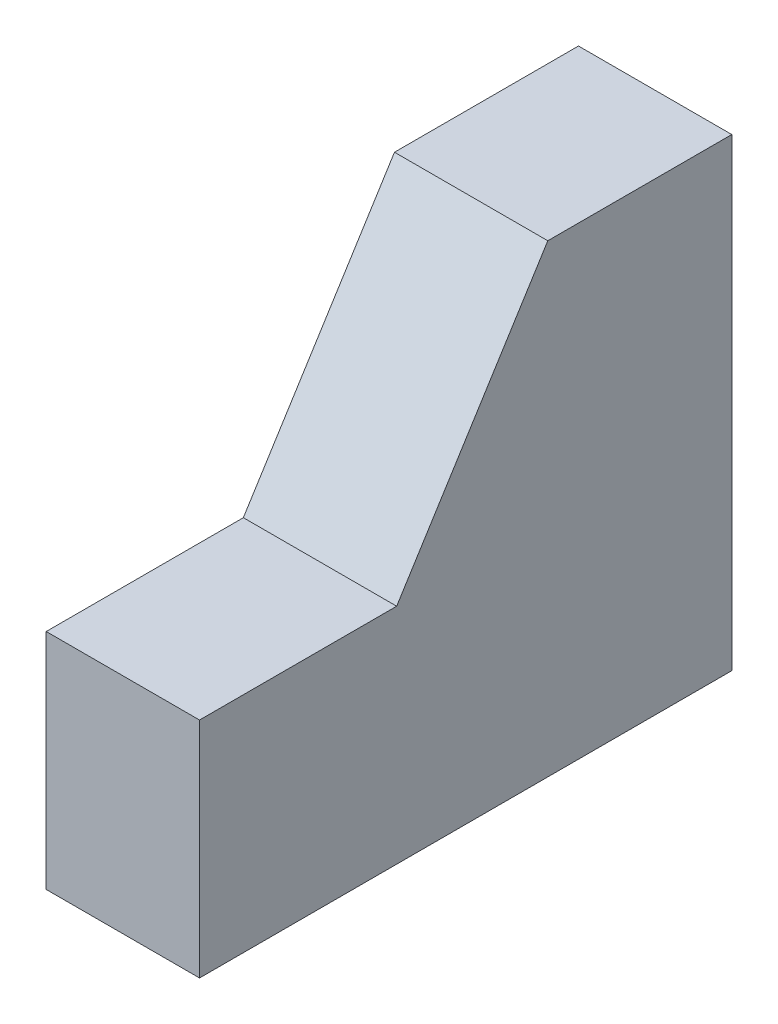
ISO-10303-21;
HEADER;
FILE_DESCRIPTION(('STEP AP214'),'2;1');
FILE_NAME('part.step','',(''),(''),'','','');
FILE_SCHEMA(('AUTOMOTIVE_DESIGN { 1 0 10303 214 1 1 1 1 }'));
ENDSEC;
DATA;
#1=APPLICATION_CONTEXT('core data for automotive mechanical design processes');
#2=APPLICATION_PROTOCOL_DEFINITION('international standard','automotive_design',2000,#1);
#3=PRODUCT_CONTEXT('',#1,'mechanical');
#4=PRODUCT('Part','Part','',(#3));
#5=PRODUCT_RELATED_PRODUCT_CATEGORY('part','',(#4));
#6=PRODUCT_DEFINITION_FORMATION('','',#4);
#7=PRODUCT_DEFINITION_CONTEXT('part definition',#1,'design');
#8=PRODUCT_DEFINITION('design','',#6,#7);
#9=PRODUCT_DEFINITION_SHAPE('','',#8);
#10=(LENGTH_UNIT() NAMED_UNIT(*) SI_UNIT(.MILLI.,.METRE.));
#11=(NAMED_UNIT(*) PLANE_ANGLE_UNIT() SI_UNIT($,.RADIAN.));
#12=(NAMED_UNIT(*) SI_UNIT($,.STERADIAN.) SOLID_ANGLE_UNIT());
#13=UNCERTAINTY_MEASURE_WITH_UNIT(LENGTH_MEASURE(1.E-05),#10,'distance_accuracy_value','');
#14=(GEOMETRIC_REPRESENTATION_CONTEXT(3) GLOBAL_UNCERTAINTY_ASSIGNED_CONTEXT((#13)) GLOBAL_UNIT_ASSIGNED_CONTEXT((#10,
#11,#12)) REPRESENTATION_CONTEXT('',''));
#15=CARTESIAN_POINT('',(0.,0.,0.));
#16=DIRECTION('',(0.,0.,1.));
#17=DIRECTION('',(1.,0.,0.));
#18=AXIS2_PLACEMENT_3D('',#15,#16,#17);
#19=CARTESIAN_POINT('',(7.,0.,-24.3));
#20=DIRECTION('',(0.,1.,0.));
#21=DIRECTION('',(0.,0.,1.));
#22=AXIS2_PLACEMENT_3D('',#19,#20,#21);
#23=PLANE('',#22);
#24=CARTESIAN_POINT('',(3.5,0.,-5.35));
#25=DIRECTION('',(0.,-1.,0.));
#26=DIRECTION('',(0.,0.,-1.));
#27=AXIS2_PLACEMENT_3D('',#24,#25,#26);
#28=CIRCLE('',#27,1.45);
#29=CARTESIAN_POINT('',(3.5,0.,-6.8));
#30=VERTEX_POINT('',#29);
#31=EDGE_CURVE('E161',#30,#30,#28,.T.);
#32=ORIENTED_EDGE('',*,*,#31,.F.);
#33=EDGE_LOOP('',(#32));
#34=FACE_BOUND('',#33,.T.);
#35=CARTESIAN_POINT('',(3.5,0.,-14.75));
#36=DIRECTION('',(0.,-1.,0.));
#37=DIRECTION('',(0.,0.,-1.));
#38=AXIS2_PLACEMENT_3D('',#35,#36,#37);
#39=CIRCLE('',#38,1.45);
#40=CARTESIAN_POINT('',(3.5,0.,-16.2));
#41=VERTEX_POINT('',#40);
#42=EDGE_CURVE('E164',#41,#41,#39,.T.);
#43=ORIENTED_EDGE('',*,*,#42,.F.);
#44=EDGE_LOOP('',(#43));
#45=FACE_BOUND('',#44,.T.);
#46=DIRECTION('',(0.,0.,-1.));
#47=VECTOR('',#46,1.);
#48=CARTESIAN_POINT('',(0.,0.,-24.3));
#49=LINE('',#48,#47);
#50=CARTESIAN_POINT('',(0.,0.,0.));
#51=VERTEX_POINT('',#50);
#52=CARTESIAN_POINT('',(0.,0.,-24.3));
#53=VERTEX_POINT('',#52);
#54=EDGE_CURVE('E117',#51,#53,#49,.T.);
#55=ORIENTED_EDGE('',*,*,#54,.T.);
#56=DIRECTION('',(-1.,0.,0.));
#57=VECTOR('',#56,1.);
#58=CARTESIAN_POINT('',(7.,0.,-24.3));
#59=LINE('',#58,#57);
#60=CARTESIAN_POINT('',(7.,0.,-24.3));
#61=VERTEX_POINT('',#60);
#62=EDGE_CURVE('E11',#61,#53,#59,.T.);
#63=ORIENTED_EDGE('',*,*,#62,.F.);
#64=DIRECTION('',(0.,0.,-1.));
#65=VECTOR('',#64,1.);
#66=CARTESIAN_POINT('',(7.,0.,-24.3));
#67=LINE('',#66,#65);
#68=CARTESIAN_POINT('',(7.,0.,0.));
#69=VERTEX_POINT('',#68);
#70=EDGE_CURVE('E128',#69,#61,#67,.T.);
#71=ORIENTED_EDGE('',*,*,#70,.F.);
#72=DIRECTION('',(-1.,0.,0.));
#73=VECTOR('',#72,1.);
#74=CARTESIAN_POINT('',(7.,0.,0.));
#75=LINE('',#74,#73);
#76=EDGE_CURVE('E113',#69,#51,#75,.T.);
#77=ORIENTED_EDGE('',*,*,#76,.T.);
#78=EDGE_LOOP('',(#55,#63,#71,#77));
#79=FACE_BOUND('',#78,.T.);
#80=ADVANCED_FACE('F33',(#34,#45,#79),#23,.F.);
#81=CARTESIAN_POINT('',(7.,21.2,-24.3));
#82=DIRECTION('',(0.,0.,1.));
#83=DIRECTION('',(0.,-1.,0.));
#84=AXIS2_PLACEMENT_3D('',#81,#82,#83);
#85=PLANE('',#84);
#86=CARTESIAN_POINT('',(3.5,15.75,-24.3));
#87=DIRECTION('',(0.,0.,-1.));
#88=DIRECTION('',(0.,1.,0.));
#89=AXIS2_PLACEMENT_3D('',#86,#87,#88);
#90=CIRCLE('',#89,1.45);
#91=CARTESIAN_POINT('',(3.5,17.2,-24.3));
#92=VERTEX_POINT('',#91);
#93=EDGE_CURVE('E172',#92,#92,#90,.T.);
#94=ORIENTED_EDGE('',*,*,#93,.F.);
#95=EDGE_LOOP('',(#94));
#96=FACE_BOUND('',#95,.T.);
#97=CARTESIAN_POINT('',(3.5,5.35,-24.3));
#98=DIRECTION('',(0.,0.,-1.));
#99=DIRECTION('',(0.,1.,0.));
#100=AXIS2_PLACEMENT_3D('',#97,#98,#99);
#101=CIRCLE('',#100,1.45);
#102=CARTESIAN_POINT('',(3.5,6.8,-24.3));
#103=VERTEX_POINT('',#102);
#104=EDGE_CURVE('E180',#103,#103,#101,.T.);
#105=ORIENTED_EDGE('',*,*,#104,.F.);
#106=EDGE_LOOP('',(#105));
#107=FACE_BOUND('',#106,.T.);
#108=DIRECTION('',(0.,1.,0.));
#109=VECTOR('',#108,1.);
#110=CARTESIAN_POINT('',(0.,21.2,-24.3));
#111=LINE('',#110,#109);
#112=CARTESIAN_POINT('',(0.,21.2,-24.3));
#113=VERTEX_POINT('',#112);
#114=EDGE_CURVE('E120',#53,#113,#111,.T.);
#115=ORIENTED_EDGE('',*,*,#114,.T.);
#116=DIRECTION('',(-1.,0.,0.));
#117=VECTOR('',#116,1.);
#118=CARTESIAN_POINT('',(7.,21.2,-24.3));
#119=LINE('',#118,#117);
#120=CARTESIAN_POINT('',(7.,21.2,-24.3));
#121=VERTEX_POINT('',#120);
#122=EDGE_CURVE('E41',#121,#113,#119,.T.);
#123=ORIENTED_EDGE('',*,*,#122,.F.);
#124=DIRECTION('',(0.,1.,0.));
#125=VECTOR('',#124,1.);
#126=CARTESIAN_POINT('',(7.,21.2,-24.3));
#127=LINE('',#126,#125);
#128=EDGE_CURVE('E86',#61,#121,#127,.T.);
#129=ORIENTED_EDGE('',*,*,#128,.F.);
#130=ORIENTED_EDGE('',*,*,#62,.T.);
#131=EDGE_LOOP('',(#115,#123,#129,#130));
#132=FACE_BOUND('',#131,.T.);
#133=ADVANCED_FACE('F152',(#96,#107,#132),#85,.F.);
#134=CARTESIAN_POINT('',(7.,21.2,-15.9));
#135=DIRECTION('',(0.,-1.,0.));
#136=DIRECTION('',(0.,0.,-1.));
#137=AXIS2_PLACEMENT_3D('',#134,#135,#136);
#138=PLANE('',#137);
#139=DIRECTION('',(0.,0.,1.));
#140=VECTOR('',#139,1.);
#141=CARTESIAN_POINT('',(0.,21.2,-15.9));
#142=LINE('',#141,#140);
#143=CARTESIAN_POINT('',(0.,21.2,-15.9));
#144=VERTEX_POINT('',#143);
#145=EDGE_CURVE('E123',#113,#144,#142,.T.);
#146=ORIENTED_EDGE('',*,*,#145,.T.);
#147=DIRECTION('',(-1.,0.,0.));
#148=VECTOR('',#147,1.);
#149=CARTESIAN_POINT('',(7.,21.2,-15.9));
#150=LINE('',#149,#148);
#151=CARTESIAN_POINT('',(7.,21.2,-15.9));
#152=VERTEX_POINT('',#151);
#153=EDGE_CURVE('E108',#152,#144,#150,.T.);
#154=ORIENTED_EDGE('',*,*,#153,.F.);
#155=DIRECTION('',(0.,0.,1.));
#156=VECTOR('',#155,1.);
#157=CARTESIAN_POINT('',(7.,21.2,-15.9));
#158=LINE('',#157,#156);
#159=EDGE_CURVE('E99',#121,#152,#158,.T.);
#160=ORIENTED_EDGE('',*,*,#159,.F.);
#161=ORIENTED_EDGE('',*,*,#122,.T.);
#162=EDGE_LOOP('',(#146,#154,#160,#161));
#163=FACE_BOUND('',#162,.T.);
#164=ADVANCED_FACE('F134',(#163),#138,.F.);
#165=CARTESIAN_POINT('',(7.,10.2,-9.));
#166=DIRECTION('',(0.,-0.531382718815397,-0.84713187057527));
#167=DIRECTION('',(0.,0.847131870575271,-0.531382718815397));
#168=AXIS2_PLACEMENT_3D('',#165,#166,#167);
#169=PLANE('',#168);
#170=DIRECTION('',(0.,-0.847131870575271,0.531382718815397));
#171=VECTOR('',#170,1.);
#172=CARTESIAN_POINT('',(0.,10.2,-9.));
#173=LINE('',#172,#171);
#174=CARTESIAN_POINT('',(0.,10.2,-9.));
#175=VERTEX_POINT('',#174);
#176=EDGE_CURVE('E107',#144,#175,#173,.T.);
#177=ORIENTED_EDGE('',*,*,#176,.T.);
#178=DIRECTION('',(-1.,0.,0.));
#179=VECTOR('',#178,1.);
#180=CARTESIAN_POINT('',(7.,10.2,-9.));
#181=LINE('',#180,#179);
#182=CARTESIAN_POINT('',(7.,10.2,-9.));
#183=VERTEX_POINT('',#182);
#184=EDGE_CURVE('E104',#183,#175,#181,.T.);
#185=ORIENTED_EDGE('',*,*,#184,.F.);
#186=DIRECTION('',(0.,-0.847131870575271,0.531382718815397));
#187=VECTOR('',#186,1.);
#188=CARTESIAN_POINT('',(7.,10.2,-9.));
#189=LINE('',#188,#187);
#190=EDGE_CURVE('E93',#152,#183,#189,.T.);
#191=ORIENTED_EDGE('',*,*,#190,.F.);
#192=ORIENTED_EDGE('',*,*,#153,.T.);
#193=EDGE_LOOP('',(#177,#185,#191,#192));
#194=FACE_BOUND('',#193,.T.);
#195=ADVANCED_FACE('F105',(#194),#169,.F.);
#196=CARTESIAN_POINT('',(7.,10.2,0.));
#197=DIRECTION('',(0.,-1.,0.));
#198=DIRECTION('',(0.,0.,-1.));
#199=AXIS2_PLACEMENT_3D('',#196,#197,#198);
#200=PLANE('',#199);
#201=DIRECTION('',(0.,0.,1.));
#202=VECTOR('',#201,1.);
#203=CARTESIAN_POINT('',(0.,10.2,0.));
#204=LINE('',#203,#202);
#205=CARTESIAN_POINT('',(0.,10.2,0.));
#206=VERTEX_POINT('',#205);
#207=EDGE_CURVE('E72',#175,#206,#204,.T.);
#208=ORIENTED_EDGE('',*,*,#207,.T.);
#209=DIRECTION('',(-1.,0.,0.));
#210=VECTOR('',#209,1.);
#211=CARTESIAN_POINT('',(7.,10.2,0.));
#212=LINE('',#211,#210);
#213=CARTESIAN_POINT('',(7.,10.2,0.));
#214=VERTEX_POINT('',#213);
#215=EDGE_CURVE('E109',#214,#206,#212,.T.);
#216=ORIENTED_EDGE('',*,*,#215,.F.);
#217=DIRECTION('',(0.,0.,1.));
#218=VECTOR('',#217,1.);
#219=CARTESIAN_POINT('',(7.,10.2,0.));
#220=LINE('',#219,#218);
#221=EDGE_CURVE('E97',#183,#214,#220,.T.);
#222=ORIENTED_EDGE('',*,*,#221,.F.);
#223=ORIENTED_EDGE('',*,*,#184,.T.);
#224=EDGE_LOOP('',(#208,#216,#222,#223));
#225=FACE_BOUND('',#224,.T.);
#226=ADVANCED_FACE('F111',(#225),#200,.F.);
#227=CARTESIAN_POINT('',(7.,0.,0.));
#228=DIRECTION('',(0.,0.,-1.));
#229=DIRECTION('',(-1.,0.,0.));
#230=AXIS2_PLACEMENT_3D('',#227,#228,#229);
#231=PLANE('',#230);
#232=DIRECTION('',(0.,-1.,0.));
#233=VECTOR('',#232,1.);
#234=CARTESIAN_POINT('',(0.,0.,0.));
#235=LINE('',#234,#233);
#236=EDGE_CURVE('E78',#206,#51,#235,.T.);
#237=ORIENTED_EDGE('',*,*,#236,.T.);
#238=ORIENTED_EDGE('',*,*,#76,.F.);
#239=DIRECTION('',(0.,-1.,0.));
#240=VECTOR('',#239,1.);
#241=CARTESIAN_POINT('',(7.,0.,0.));
#242=LINE('',#241,#240);
#243=EDGE_CURVE('E49',#214,#69,#242,.T.);
#244=ORIENTED_EDGE('',*,*,#243,.F.);
#245=ORIENTED_EDGE('',*,*,#215,.T.);
#246=EDGE_LOOP('',(#237,#238,#244,#245));
#247=FACE_BOUND('',#246,.T.);
#248=ADVANCED_FACE('F141',(#247),#231,.F.);
#249=CARTESIAN_POINT('',(7.,0.,0.));
#250=DIRECTION('',(-1.,0.,0.));
#251=DIRECTION('',(0.,0.,1.));
#252=AXIS2_PLACEMENT_3D('',#249,#250,#251);
#253=PLANE('',#252);
#254=ORIENTED_EDGE('',*,*,#70,.T.);
#255=ORIENTED_EDGE('',*,*,#128,.T.);
#256=ORIENTED_EDGE('',*,*,#159,.T.);
#257=ORIENTED_EDGE('',*,*,#190,.T.);
#258=ORIENTED_EDGE('',*,*,#221,.T.);
#259=ORIENTED_EDGE('',*,*,#243,.T.);
#260=EDGE_LOOP('',(#254,#255,#256,#257,#258,#259));
#261=FACE_BOUND('',#260,.T.);
#262=ADVANCED_FACE('F95',(#261),#253,.F.);
#263=CARTESIAN_POINT('',(0.,0.,0.));
#264=DIRECTION('',(-1.,0.,0.));
#265=DIRECTION('',(0.,0.,1.));
#266=AXIS2_PLACEMENT_3D('',#263,#264,#265);
#267=PLANE('',#266);
#268=ORIENTED_EDGE('',*,*,#54,.F.);
#269=ORIENTED_EDGE('',*,*,#236,.F.);
#270=ORIENTED_EDGE('',*,*,#207,.F.);
#271=ORIENTED_EDGE('',*,*,#176,.F.);
#272=ORIENTED_EDGE('',*,*,#145,.F.);
#273=ORIENTED_EDGE('',*,*,#114,.F.);
#274=EDGE_LOOP('',(#268,#269,#270,#271,#272,#273));
#275=FACE_BOUND('',#274,.T.);
#276=ADVANCED_FACE('F137',(#275),#267,.T.);
#277=CARTESIAN_POINT('',(3.5,7.5,-14.75));
#278=DIRECTION('',(0.,-1.,0.));
#279=DIRECTION('',(0.,0.,-1.));
#280=AXIS2_PLACEMENT_3D('',#277,#278,#279);
#281=CYLINDRICAL_SURFACE('',#280,1.45);
#282=CARTESIAN_POINT('',(3.5,7.5,-14.75));
#283=DIRECTION('',(0.,-1.,0.));
#284=DIRECTION('',(0.,0.,-1.));
#285=AXIS2_PLACEMENT_3D('',#282,#283,#284);
#286=CIRCLE('',#285,1.45);
#287=CARTESIAN_POINT('',(3.5,7.5,-16.2));
#288=VERTEX_POINT('',#287);
#289=EDGE_CURVE('E166',#288,#288,#286,.T.);
#290=ORIENTED_EDGE('',*,*,#289,.F.);
#291=EDGE_LOOP('',(#290));
#292=FACE_BOUND('',#291,.T.);
#293=ORIENTED_EDGE('',*,*,#42,.T.);
#294=EDGE_LOOP('',(#293));
#295=FACE_BOUND('',#294,.T.);
#296=ADVANCED_FACE('F217',(#292,#295),#281,.F.);
#297=CARTESIAN_POINT('',(3.5,7.5,-14.75));
#298=DIRECTION('',(0.,-1.,0.));
#299=DIRECTION('',(0.,0.,-1.));
#300=AXIS2_PLACEMENT_3D('',#297,#298,#299);
#301=PLANE('',#300);
#302=ORIENTED_EDGE('',*,*,#289,.T.);
#303=EDGE_LOOP('',(#302));
#304=FACE_BOUND('',#303,.T.);
#305=ADVANCED_FACE('F213',(#304),#301,.T.);
#306=CARTESIAN_POINT('',(3.5,7.5,-5.35));
#307=DIRECTION('',(0.,-1.,0.));
#308=DIRECTION('',(0.,0.,-1.));
#309=AXIS2_PLACEMENT_3D('',#306,#307,#308);
#310=CYLINDRICAL_SURFACE('',#309,1.45);
#311=CARTESIAN_POINT('',(3.5,7.5,-5.35));
#312=DIRECTION('',(0.,-1.,0.));
#313=DIRECTION('',(0.,0.,-1.));
#314=AXIS2_PLACEMENT_3D('',#311,#312,#313);
#315=CIRCLE('',#314,1.45);
#316=CARTESIAN_POINT('',(3.5,7.5,-6.8));
#317=VERTEX_POINT('',#316);
#318=EDGE_CURVE('E121',#317,#317,#315,.T.);
#319=ORIENTED_EDGE('',*,*,#318,.F.);
#320=EDGE_LOOP('',(#319));
#321=FACE_BOUND('',#320,.T.);
#322=ORIENTED_EDGE('',*,*,#31,.T.);
#323=EDGE_LOOP('',(#322));
#324=FACE_BOUND('',#323,.T.);
#325=ADVANCED_FACE('F205',(#321,#324),#310,.F.);
#326=CARTESIAN_POINT('',(3.5,7.5,-5.35));
#327=DIRECTION('',(0.,-1.,0.));
#328=DIRECTION('',(0.,0.,-1.));
#329=AXIS2_PLACEMENT_3D('',#326,#327,#328);
#330=PLANE('',#329);
#331=ORIENTED_EDGE('',*,*,#318,.T.);
#332=EDGE_LOOP('',(#331));
#333=FACE_BOUND('',#332,.T.);
#334=ADVANCED_FACE('F196',(#333),#330,.T.);
#335=CARTESIAN_POINT('',(3.5,5.35,-16.8));
#336=DIRECTION('',(0.,0.,-1.));
#337=DIRECTION('',(0.,1.,0.));
#338=AXIS2_PLACEMENT_3D('',#335,#336,#337);
#339=CYLINDRICAL_SURFACE('',#338,1.45);
#340=CARTESIAN_POINT('',(3.5,5.35,-16.8));
#341=DIRECTION('',(0.,0.,-1.));
#342=DIRECTION('',(0.,1.,0.));
#343=AXIS2_PLACEMENT_3D('',#340,#341,#342);
#344=CIRCLE('',#343,1.45);
#345=CARTESIAN_POINT('',(3.5,6.8,-16.8));
#346=VERTEX_POINT('',#345);
#347=EDGE_CURVE('E183',#346,#346,#344,.T.);
#348=ORIENTED_EDGE('',*,*,#347,.F.);
#349=EDGE_LOOP('',(#348));
#350=FACE_BOUND('',#349,.T.);
#351=ORIENTED_EDGE('',*,*,#104,.T.);
#352=EDGE_LOOP('',(#351));
#353=FACE_BOUND('',#352,.T.);
#354=ADVANCED_FACE('F193',(#350,#353),#339,.F.);
#355=CARTESIAN_POINT('',(3.5,5.35,-16.8));
#356=DIRECTION('',(0.,0.,-1.));
#357=DIRECTION('',(0.,1.,0.));
#358=AXIS2_PLACEMENT_3D('',#355,#356,#357);
#359=PLANE('',#358);
#360=ORIENTED_EDGE('',*,*,#347,.T.);
#361=EDGE_LOOP('',(#360));
#362=FACE_BOUND('',#361,.T.);
#363=ADVANCED_FACE('F195',(#362),#359,.T.);
#364=CARTESIAN_POINT('',(3.5,15.75,-16.8));
#365=DIRECTION('',(0.,0.,-1.));
#366=DIRECTION('',(0.,1.,0.));
#367=AXIS2_PLACEMENT_3D('',#364,#365,#366);
#368=CYLINDRICAL_SURFACE('',#367,1.45);
#369=CARTESIAN_POINT('',(3.5,15.75,-16.8));
#370=DIRECTION('',(0.,0.,-1.));
#371=DIRECTION('',(0.,1.,0.));
#372=AXIS2_PLACEMENT_3D('',#369,#370,#371);
#373=CIRCLE('',#372,1.45);
#374=CARTESIAN_POINT('',(3.5,17.2,-16.8));
#375=VERTEX_POINT('',#374);
#376=EDGE_CURVE('E167',#375,#375,#373,.T.);
#377=ORIENTED_EDGE('',*,*,#376,.F.);
#378=EDGE_LOOP('',(#377));
#379=FACE_BOUND('',#378,.T.);
#380=ORIENTED_EDGE('',*,*,#93,.T.);
#381=EDGE_LOOP('',(#380));
#382=FACE_BOUND('',#381,.T.);
#383=ADVANCED_FACE('F189',(#379,#382),#368,.F.);
#384=CARTESIAN_POINT('',(3.5,15.75,-16.8));
#385=DIRECTION('',(0.,0.,-1.));
#386=DIRECTION('',(0.,1.,0.));
#387=AXIS2_PLACEMENT_3D('',#384,#385,#386);
#388=PLANE('',#387);
#389=ORIENTED_EDGE('',*,*,#376,.T.);
#390=EDGE_LOOP('',(#389));
#391=FACE_BOUND('',#390,.T.);
#392=ADVANCED_FACE('F270',(#391),#388,.T.);
#393=CLOSED_SHELL('',(#80,#133,#164,#195,#226,#248,#262,#276,#296,#305,#325,#334,#354,#363,#383,#392));
#394=MANIFOLD_SOLID_BREP('B2',#393);
#395=ADVANCED_BREP_SHAPE_REPRESENTATION('',(#18,#394),#14);
#396=SHAPE_DEFINITION_REPRESENTATION(#9,#395);
ENDSEC;
END-ISO-10303-21;
